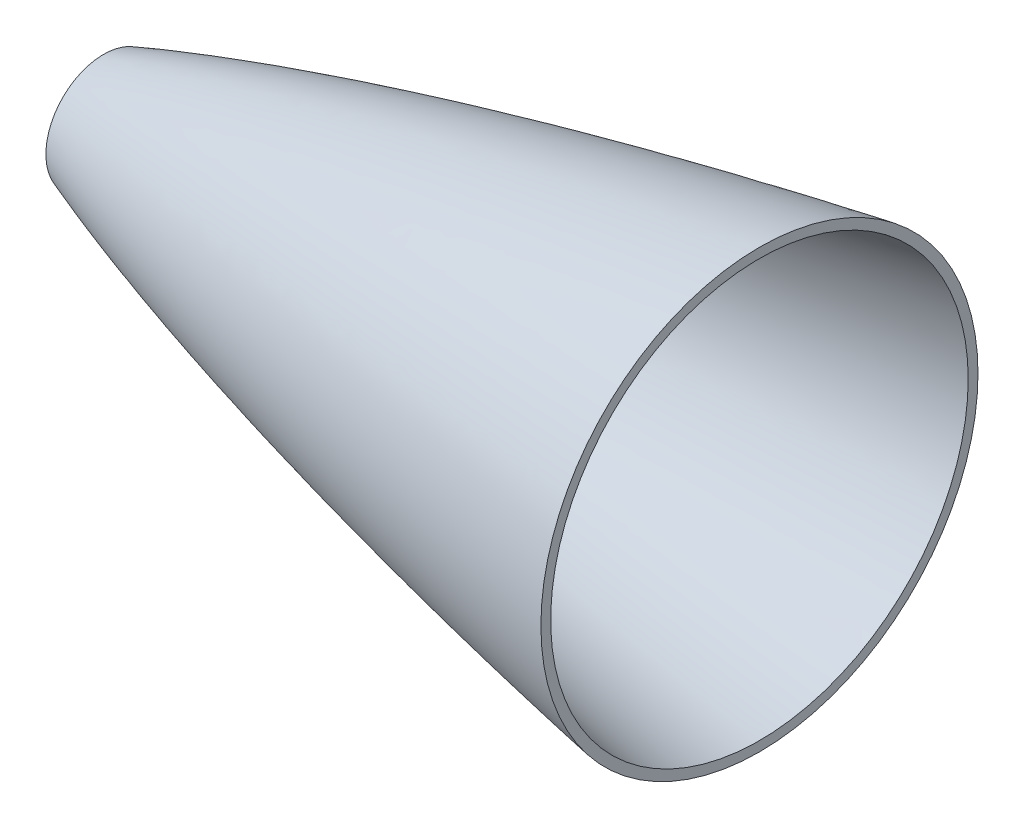
ISO-10303-21;
HEADER;
FILE_DESCRIPTION(('STEP AP214'),'2;1');
FILE_NAME('part.step','',(''),(''),'','','');
FILE_SCHEMA(('AUTOMOTIVE_DESIGN { 1 0 10303 214 1 1 1 1 }'));
ENDSEC;
DATA;
#1=APPLICATION_CONTEXT('core data for automotive mechanical design processes');
#2=APPLICATION_PROTOCOL_DEFINITION('international standard','automotive_design',2000,#1);
#3=PRODUCT_CONTEXT('',#1,'mechanical');
#4=PRODUCT('Part','Part','',(#3));
#5=PRODUCT_RELATED_PRODUCT_CATEGORY('part','',(#4));
#6=PRODUCT_DEFINITION_FORMATION('','',#4);
#7=PRODUCT_DEFINITION_CONTEXT('part definition',#1,'design');
#8=PRODUCT_DEFINITION('design','',#6,#7);
#9=PRODUCT_DEFINITION_SHAPE('','',#8);
#10=(LENGTH_UNIT() NAMED_UNIT(*) SI_UNIT(.MILLI.,.METRE.));
#11=(NAMED_UNIT(*) PLANE_ANGLE_UNIT() SI_UNIT($,.RADIAN.));
#12=(NAMED_UNIT(*) SI_UNIT($,.STERADIAN.) SOLID_ANGLE_UNIT());
#13=UNCERTAINTY_MEASURE_WITH_UNIT(LENGTH_MEASURE(1.E-05),#10,'distance_accuracy_value','');
#14=(GEOMETRIC_REPRESENTATION_CONTEXT(3) GLOBAL_UNCERTAINTY_ASSIGNED_CONTEXT((#13)) GLOBAL_UNIT_ASSIGNED_CONTEXT((#10,
#11,#12)) REPRESENTATION_CONTEXT('',''));
#15=CARTESIAN_POINT('',(0.,0.,0.));
#16=DIRECTION('',(0.,0.,1.));
#17=DIRECTION('',(1.,0.,0.));
#18=AXIS2_PLACEMENT_3D('',#15,#16,#17);
#19=CARTESIAN_POINT('',(457.2,95.2499999863099,0.));
#20=CARTESIAN_POINT('',(455.973700484007,95.2442558489218,0.));
#21=CARTESIAN_POINT('',(453.521410507465,95.2001609293709,0.));
#22=CARTESIAN_POINT('',(448.618051981354,95.0620461285506,0.));
#23=CARTESIAN_POINT('',(440.032338734873,94.6975648763611,0.));
#24=CARTESIAN_POINT('',(428.99507734638,94.0675681603095,0.));
#25=CARTESIAN_POINT('',(411.834102605625,92.8373554040269,0.));
#26=CARTESIAN_POINT('',(389.792768776019,90.8705573506526,0.));
#27=CARTESIAN_POINT('',(364.121565724609,88.1293712554599,0.));
#28=CARTESIAN_POINT('',(334.84304941187,84.4812168471433,0.));
#29=CARTESIAN_POINT('',(305.625866718072,80.3721875169129,0.));
#30=CARTESIAN_POINT('',(276.472706829773,75.8317963448619,0.));
#31=CARTESIAN_POINT('',(247.387631707993,70.8740216213803,0.));
#32=CARTESIAN_POINT('',(218.376688060461,65.4994445148525,0.));
#33=CARTESIAN_POINT('',(189.448153440764,59.6968671983802,0.));
#34=CARTESIAN_POINT('',(160.614305525022,53.4402971568738,0.));
#35=CARTESIAN_POINT('',(131.892371679484,46.686426531904,0.));
#36=CARTESIAN_POINT('',(103.310212009362,39.3619752554907,0.));
#37=CARTESIAN_POINT('',(75.6130579703372,31.5462124058929,0.));
#38=CARTESIAN_POINT('',(51.6882713202313,23.9818909923328,0.));
#39=CARTESIAN_POINT('',(32.6155540991965,17.1304800128776,0.));
#40=CARTESIAN_POINT('',(19.2936045724269,11.6017464036061,0.));
#41=CARTESIAN_POINT('',(11.4561201377879,7.87661771037368,0.));
#42=CARTESIAN_POINT('',(6.61398983203532,5.22529479758573,0.));
#43=CARTESIAN_POINT('',(3.82527199485086,3.46661844296927,0.));
#44=CARTESIAN_POINT('',(2.23811863344633,2.31922525620693,0.));
#45=CARTESIAN_POINT('',(1.3250808545305,1.56516933155385,0.));
#46=CARTESIAN_POINT('',(0.802086139992584,1.07329374189902,0.));
#47=CARTESIAN_POINT('',(0.508304998244186,0.760811711281794,0.));
#48=CARTESIAN_POINT('',(0.336037993223269,0.556544125855294,0.));
#49=CARTESIAN_POINT('',(0.220401302941073,0.406590083529717,0.));
#50=CARTESIAN_POINT('',(0.135390601814985,0.284235784515475,0.));
#51=CARTESIAN_POINT('',(0.0705930880732007,0.176725306763241,0.));
#52=CARTESIAN_POINT('',(0.0261974766976189,0.0850108023905772,0.));
#53=CARTESIAN_POINT('',(0.00822914946549372,0.0372713204893021,0.));
#54=CARTESIAN_POINT('',(0.0022614130657891,0.0125596339287031,0.));
#55=CARTESIAN_POINT('',(0.,0.,0.));
#56=B_SPLINE_CURVE_WITH_KNOTS('',4,(#19,#20,#21,#22,#23,#24,#25,#26,#27,#28,#29,#30,#31,#32,#33,
#34,#35,#36,#37,#38,#39,#40,#41,#42,#43,#44,#45,#46,#47,#48,#49,#50,#51,#52,#53,#54,#55),
.UNSPECIFIED.,.F.,.F.,(5,1,1,1,1,1,1,1,1,1,1,1,1,1,1,1,1,1,1,1,1,1,1,1,1,1,1,1,1,1,1,1,1,5),(0.,
0.010433363720785,0.0208667274415699,0.04173345488314,0.0731105437816442,0.104487632680148,
0.167241811319938,0.229995988937202,0.292750168797301,0.355504348198085,0.418258525795471,
0.481012702217603,0.543766882150059,0.606521057825231,0.669275237475743,0.7320294122646,
0.794783588320637,0.857537756842973,0.914093471826865,0.945470440384322,0.967145650741062,
0.980209293857501,0.987888433943443,0.992411964952562,0.995178478008313,0.996861315149704,
0.997956396193869,0.998516518943817,0.998825285148766,0.999134051353716,0.999567025676858,
0.999783512838429,0.999891756419214,1.),.UNSPECIFIED.);
#57=CARTESIAN_POINT('',(457.2,0.,0.));
#58=DIRECTION('',(1.,0.,0.));
#59=AXIS1_PLACEMENT('',#57,#58);
#60=SURFACE_OF_REVOLUTION('',#56,#59);
#61=CARTESIAN_POINT('',(38.1,0.,0.));
#62=DIRECTION('',(1.,0.,0.));
#63=DIRECTION('',(0.,0.,-1.));
#64=AXIS2_PLACEMENT_3D('',#61,#62,#63);
#65=CIRCLE('',#64,19.0031217051458);
#66=CARTESIAN_POINT('',(38.1,0.,-19.0031217051458));
#67=VERTEX_POINT('',#66);
#68=EDGE_CURVE('E10',#67,#67,#65,.F.);
#69=ORIENTED_EDGE('',*,*,#68,.F.);
#70=EDGE_LOOP('',(#69));
#71=FACE_BOUND('',#70,.T.);
#72=CARTESIAN_POINT('',(254.,0.,0.));
#73=DIRECTION('',(1.,0.,0.));
#74=DIRECTION('',(0.,0.,-1.));
#75=AXIS2_PLACEMENT_3D('',#72,#73,#74);
#76=CIRCLE('',#75,71.9493683703437);
#77=CARTESIAN_POINT('',(254.,0.,-71.9493683703437));
#78=VERTEX_POINT('',#77);
#79=EDGE_CURVE('E46',#78,#78,#76,.F.);
#80=ORIENTED_EDGE('',*,*,#79,.T.);
#81=EDGE_LOOP('',(#80));
#82=FACE_BOUND('',#81,.T.);
#83=ADVANCED_FACE('F33',(#71,#82),#60,.F.);
#84=CARTESIAN_POINT('',(457.2,95.2499999863099,0.));
#85=CARTESIAN_POINT('',(455.973700484007,95.2442558489218,0.));
#86=CARTESIAN_POINT('',(453.521410507465,95.2001609293709,0.));
#87=CARTESIAN_POINT('',(448.618051981354,95.0620461285506,0.));
#88=CARTESIAN_POINT('',(440.032338734873,94.6975648763611,0.));
#89=CARTESIAN_POINT('',(428.99507734638,94.0675681603095,0.));
#90=CARTESIAN_POINT('',(411.834102605625,92.8373554040269,0.));
#91=CARTESIAN_POINT('',(389.792768776019,90.8705573506526,0.));
#92=CARTESIAN_POINT('',(364.121565724609,88.1293712554599,0.));
#93=CARTESIAN_POINT('',(334.84304941187,84.4812168471433,0.));
#94=CARTESIAN_POINT('',(305.625866718072,80.3721875169129,0.));
#95=CARTESIAN_POINT('',(276.472706829773,75.8317963448619,0.));
#96=CARTESIAN_POINT('',(247.387631707993,70.8740216213803,0.));
#97=CARTESIAN_POINT('',(218.376688060461,65.4994445148525,0.));
#98=CARTESIAN_POINT('',(189.448153440764,59.6968671983802,0.));
#99=CARTESIAN_POINT('',(160.614305525022,53.4402971568738,0.));
#100=CARTESIAN_POINT('',(131.892371679484,46.686426531904,0.));
#101=CARTESIAN_POINT('',(103.310212009362,39.3619752554907,0.));
#102=CARTESIAN_POINT('',(75.6130579703372,31.5462124058929,0.));
#103=CARTESIAN_POINT('',(51.6882713202313,23.9818909923328,0.));
#104=CARTESIAN_POINT('',(32.6155540991965,17.1304800128776,0.));
#105=CARTESIAN_POINT('',(19.2936045724269,11.6017464036061,0.));
#106=CARTESIAN_POINT('',(11.4561201377879,7.87661771037368,0.));
#107=CARTESIAN_POINT('',(6.63425473505621,5.23639090576789,0.));
#108=CARTESIAN_POINT('',(4.13957857676132,3.66481957933529,0.));
#109=CARTESIAN_POINT('',(2.98467516341605,2.85316501883657,0.));
#110=CARTESIAN_POINT('',(2.57617610379018,2.55021030335875,0.));
#111=B_SPLINE_CURVE_WITH_KNOTS('',4,(#84,#85,#86,#87,#88,#89,#90,#91,#92,#93,#94,#95,#96,#97,
#98,#99,#100,#101,#102,#103,#104,#105,#106,#107,#108,#109,#110),.UNSPECIFIED.,.F.,.F.,(5,1,1,1,
1,1,1,1,1,1,1,1,1,1,1,1,1,1,1,1,1,1,1,5),(0.,0.010433363720785,0.0208667274415699,
0.04173345488314,0.0731105437816442,0.104487632680148,0.167241811319938,0.229995988937202,
0.292750168797301,0.355504348198085,0.418258525795471,0.481012702217603,0.543766882150059,
0.606521057825231,0.669275237475743,0.7320294122646,0.794783588320637,0.857537756842973,
0.914093471826865,0.945470440384322,0.967145650741062,0.980209293857501,0.987888433943443,
0.992215508974932),.UNSPECIFIED.);
#112=CARTESIAN_POINT('',(457.2,0.,0.));
#113=DIRECTION('',(1.,0.,0.));
#114=AXIS1_PLACEMENT('',#112,#113);
#115=SURFACE_OF_REVOLUTION('',#111,#114);
#116=OFFSET_SURFACE('',#115,3.175,.F.);
#117=CARTESIAN_POINT('',(38.1,0.,0.));
#118=DIRECTION('',(1.,0.,0.));
#119=DIRECTION('',(0.,0.,-1.));
#120=AXIS2_PLACEMENT_3D('',#117,#118,#119);
#121=CIRCLE('',#120,15.6187658569106);
#122=CARTESIAN_POINT('',(38.1,0.,-15.6187658569106));
#123=VERTEX_POINT('',#122);
#124=EDGE_CURVE('E41',#123,#123,#121,.F.);
#125=ORIENTED_EDGE('',*,*,#124,.T.);
#126=EDGE_LOOP('',(#125));
#127=FACE_BOUND('',#126,.T.);
#128=CARTESIAN_POINT('',(254.,0.,0.));
#129=DIRECTION('',(1.,0.,0.));
#130=DIRECTION('',(0.,0.,-1.));
#131=AXIS2_PLACEMENT_3D('',#128,#129,#130);
#132=CIRCLE('',#131,68.7263188308299);
#133=CARTESIAN_POINT('',(254.,0.,-68.7263188308299));
#134=VERTEX_POINT('',#133);
#135=EDGE_CURVE('E37',#134,#134,#132,.F.);
#136=ORIENTED_EDGE('',*,*,#135,.F.);
#137=EDGE_LOOP('',(#136));
#138=FACE_BOUND('',#137,.T.);
#139=ADVANCED_FACE('F60',(#127,#138),#116,.T.);
#140=CARTESIAN_POINT('',(38.1,0.,0.));
#141=DIRECTION('',(1.,0.,0.));
#142=DIRECTION('',(0.,0.,-1.));
#143=AXIS2_PLACEMENT_3D('',#140,#141,#142);
#144=PLANE('',#143);
#145=ORIENTED_EDGE('',*,*,#68,.T.);
#146=EDGE_LOOP('',(#145));
#147=FACE_BOUND('',#146,.T.);
#148=ORIENTED_EDGE('',*,*,#124,.F.);
#149=EDGE_LOOP('',(#148));
#150=FACE_BOUND('',#149,.T.);
#151=ADVANCED_FACE('F63',(#147,#150),#144,.F.);
#152=CARTESIAN_POINT('',(254.,0.,0.));
#153=DIRECTION('',(1.,0.,0.));
#154=DIRECTION('',(0.,0.,-1.));
#155=AXIS2_PLACEMENT_3D('',#152,#153,#154);
#156=PLANE('',#155);
#157=ORIENTED_EDGE('',*,*,#79,.F.);
#158=EDGE_LOOP('',(#157));
#159=FACE_BOUND('',#158,.T.);
#160=ORIENTED_EDGE('',*,*,#135,.T.);
#161=EDGE_LOOP('',(#160));
#162=FACE_BOUND('',#161,.T.);
#163=ADVANCED_FACE('F67',(#159,#162),#156,.T.);
#164=CLOSED_SHELL('',(#83,#139,#151,#163));
#165=MANIFOLD_SOLID_BREP('B2',#164);
#166=ADVANCED_BREP_SHAPE_REPRESENTATION('',(#18,#165),#14);
#167=SHAPE_DEFINITION_REPRESENTATION(#9,#166);
ENDSEC;
END-ISO-10303-21;
